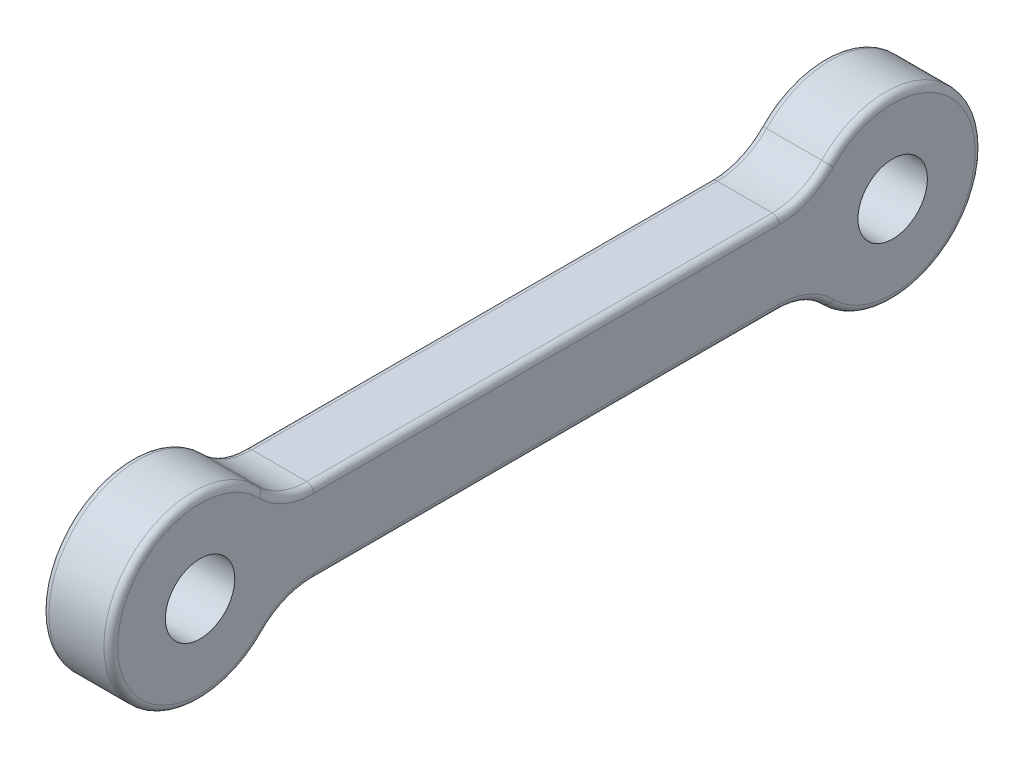
ISO-10303-21;
HEADER;
FILE_DESCRIPTION(('STEP AP214'),'2;1');
FILE_NAME('part.step','',(''),(''),'','','');
FILE_SCHEMA(('AUTOMOTIVE_DESIGN { 1 0 10303 214 1 1 1 1 }'));
ENDSEC;
DATA;
#1=APPLICATION_CONTEXT('core data for automotive mechanical design processes');
#2=APPLICATION_PROTOCOL_DEFINITION('international standard','automotive_design',2000,#1);
#3=PRODUCT_CONTEXT('',#1,'mechanical');
#4=PRODUCT('Part','Part','',(#3));
#5=PRODUCT_RELATED_PRODUCT_CATEGORY('part','',(#4));
#6=PRODUCT_DEFINITION_FORMATION('','',#4);
#7=PRODUCT_DEFINITION_CONTEXT('part definition',#1,'design');
#8=PRODUCT_DEFINITION('design','',#6,#7);
#9=PRODUCT_DEFINITION_SHAPE('','',#8);
#10=(LENGTH_UNIT() NAMED_UNIT(*) SI_UNIT(.MILLI.,.METRE.));
#11=(NAMED_UNIT(*) PLANE_ANGLE_UNIT() SI_UNIT($,.RADIAN.));
#12=(NAMED_UNIT(*) SI_UNIT($,.STERADIAN.) SOLID_ANGLE_UNIT());
#13=UNCERTAINTY_MEASURE_WITH_UNIT(LENGTH_MEASURE(1.E-05),#10,'distance_accuracy_value','');
#14=(GEOMETRIC_REPRESENTATION_CONTEXT(3) GLOBAL_UNCERTAINTY_ASSIGNED_CONTEXT((#13)) GLOBAL_UNIT_ASSIGNED_CONTEXT((#10,
#11,#12)) REPRESENTATION_CONTEXT('',''));
#15=CARTESIAN_POINT('',(0.,0.,0.));
#16=DIRECTION('',(0.,0.,1.));
#17=DIRECTION('',(1.,0.,0.));
#18=AXIS2_PLACEMENT_3D('',#15,#16,#17);
#19=CARTESIAN_POINT('',(10.,-16.,16.5227116418584));
#20=DIRECTION('',(-1.,0.,0.));
#21=DIRECTION('',(0.,0.,1.));
#22=AXIS2_PLACEMENT_3D('',#19,#20,#21);
#23=PLANE('',#22);
#24=DIRECTION('',(0.,0.,1.));
#25=VECTOR('',#24,1.);
#26=CARTESIAN_POINT('',(10.,5.,16.5227116418584));
#27=LINE('',#26,#25);
#28=CARTESIAN_POINT('',(10.,4.99999999999999,16.5227116418584));
#29=VERTEX_POINT('',#28);
#30=CARTESIAN_POINT('',(10.,5.,84.2272883581416));
#31=VERTEX_POINT('',#30);
#32=EDGE_CURVE('E55',#29,#31,#27,.T.);
#33=ORIENTED_EDGE('',*,*,#32,.T.);
#34=CARTESIAN_POINT('',(10.,16.,84.2272883581416));
#35=DIRECTION('',(-1.,0.,0.));
#36=DIRECTION('',(0.,0.,1.));
#37=AXIS2_PLACEMENT_3D('',#34,#35,#36);
#38=CIRCLE('',#37,11.);
#39=CARTESIAN_POINT('',(10.,8.34782608695652,92.1294547955521));
#40=VERTEX_POINT('',#39);
#41=EDGE_CURVE('E238',#31,#40,#38,.T.);
#42=ORIENTED_EDGE('',*,*,#41,.T.);
#43=CARTESIAN_POINT('',(10.,0.,100.75));
#44=DIRECTION('',(-1.,0.,0.));
#45=DIRECTION('',(0.,0.,1.));
#46=AXIS2_PLACEMENT_3D('',#43,#44,#45);
#47=CIRCLE('',#46,12.);
#48=CARTESIAN_POINT('',(10.,-8.34782608695652,92.1294547955521));
#49=VERTEX_POINT('',#48);
#50=EDGE_CURVE('E252',#40,#49,#47,.F.);
#51=ORIENTED_EDGE('',*,*,#50,.T.);
#52=CARTESIAN_POINT('',(10.,-16.,84.2272883581416));
#53=DIRECTION('',(-1.,0.,0.));
#54=DIRECTION('',(0.,0.,1.));
#55=AXIS2_PLACEMENT_3D('',#52,#53,#54);
#56=CIRCLE('',#55,11.);
#57=CARTESIAN_POINT('',(10.,-4.99999999999999,84.2272883581416));
#58=VERTEX_POINT('',#57);
#59=EDGE_CURVE('E250',#49,#58,#56,.T.);
#60=ORIENTED_EDGE('',*,*,#59,.T.);
#61=DIRECTION('',(0.,0.,-1.));
#62=VECTOR('',#61,1.);
#63=CARTESIAN_POINT('',(10.,-5.,16.5227116418584));
#64=LINE('',#63,#62);
#65=CARTESIAN_POINT('',(10.,-5.,16.5227116418584));
#66=VERTEX_POINT('',#65);
#67=EDGE_CURVE('E248',#58,#66,#64,.T.);
#68=ORIENTED_EDGE('',*,*,#67,.T.);
#69=CARTESIAN_POINT('',(10.,-16.,16.5227116418584));
#70=DIRECTION('',(-1.,0.,0.));
#71=DIRECTION('',(0.,0.,1.));
#72=AXIS2_PLACEMENT_3D('',#69,#70,#71);
#73=CIRCLE('',#72,11.);
#74=CARTESIAN_POINT('',(10.,-8.34782608695653,8.62054520444785));
#75=VERTEX_POINT('',#74);
#76=EDGE_CURVE('E246',#66,#75,#73,.T.);
#77=ORIENTED_EDGE('',*,*,#76,.T.);
#78=CARTESIAN_POINT('',(10.,0.,0.));
#79=DIRECTION('',(-1.,0.,0.));
#80=DIRECTION('',(0.,0.,1.));
#81=AXIS2_PLACEMENT_3D('',#78,#79,#80);
#82=CIRCLE('',#81,12.);
#83=CARTESIAN_POINT('',(10.,8.34782608695652,8.62054520444784));
#84=VERTEX_POINT('',#83);
#85=EDGE_CURVE('E244',#75,#84,#82,.F.);
#86=ORIENTED_EDGE('',*,*,#85,.T.);
#87=CARTESIAN_POINT('',(10.,16.,16.5227116418584));
#88=DIRECTION('',(-1.,0.,0.));
#89=DIRECTION('',(0.,0.,1.));
#90=AXIS2_PLACEMENT_3D('',#87,#88,#89);
#91=CIRCLE('',#90,11.);
#92=EDGE_CURVE('E60',#84,#29,#91,.T.);
#93=ORIENTED_EDGE('',*,*,#92,.T.);
#94=EDGE_LOOP('',(#33,#42,#51,#60,#68,#77,#86,#93));
#95=FACE_BOUND('',#94,.T.);
#96=CARTESIAN_POINT('',(10.,0.,100.75));
#97=DIRECTION('',(1.,0.,0.));
#98=DIRECTION('',(0.,0.,-1.));
#99=AXIS2_PLACEMENT_3D('',#96,#97,#98);
#100=CIRCLE('',#99,5.05);
#101=CARTESIAN_POINT('',(10.,0.,95.7));
#102=VERTEX_POINT('',#101);
#103=EDGE_CURVE('E311',#102,#102,#100,.T.);
#104=ORIENTED_EDGE('',*,*,#103,.F.);
#105=EDGE_LOOP('',(#104));
#106=FACE_BOUND('',#105,.T.);
#107=CARTESIAN_POINT('',(10.,0.,0.));
#108=DIRECTION('',(1.,0.,0.));
#109=DIRECTION('',(0.,0.,-1.));
#110=AXIS2_PLACEMENT_3D('',#107,#108,#109);
#111=CIRCLE('',#110,5.05);
#112=CARTESIAN_POINT('',(10.,0.,-5.05));
#113=VERTEX_POINT('',#112);
#114=EDGE_CURVE('E315',#113,#113,#111,.T.);
#115=ORIENTED_EDGE('',*,*,#114,.F.);
#116=EDGE_LOOP('',(#115));
#117=FACE_BOUND('',#116,.T.);
#118=ADVANCED_FACE('F38',(#95,#106,#117),#23,.F.);
#119=CARTESIAN_POINT('',(0.,-16.,16.5227116418584));
#120=DIRECTION('',(-1.,0.,0.));
#121=DIRECTION('',(0.,0.,1.));
#122=AXIS2_PLACEMENT_3D('',#119,#120,#121);
#123=PLANE('',#122);
#124=DIRECTION('',(0.,0.,1.));
#125=VECTOR('',#124,1.);
#126=CARTESIAN_POINT('',(0.,5.,16.5227116418584));
#127=LINE('',#126,#125);
#128=CARTESIAN_POINT('',(0.,5.,84.2272883581416));
#129=VERTEX_POINT('',#128);
#130=CARTESIAN_POINT('',(0.,5.,16.5227116418584));
#131=VERTEX_POINT('',#130);
#132=EDGE_CURVE('E292',#129,#131,#127,.F.);
#133=ORIENTED_EDGE('',*,*,#132,.T.);
#134=CARTESIAN_POINT('',(0.,16.,16.5227116418584));
#135=DIRECTION('',(-1.,0.,0.));
#136=DIRECTION('',(0.,0.,1.));
#137=AXIS2_PLACEMENT_3D('',#134,#135,#136);
#138=CIRCLE('',#137,11.);
#139=CARTESIAN_POINT('',(0.,8.34782608695652,8.62054520444784));
#140=VERTEX_POINT('',#139);
#141=EDGE_CURVE('E277',#131,#140,#138,.F.);
#142=ORIENTED_EDGE('',*,*,#141,.T.);
#143=CARTESIAN_POINT('',(0.,0.,0.));
#144=DIRECTION('',(-1.,0.,0.));
#145=DIRECTION('',(0.,0.,1.));
#146=AXIS2_PLACEMENT_3D('',#143,#144,#145);
#147=CIRCLE('',#146,12.);
#148=CARTESIAN_POINT('',(0.,-8.34782608695653,8.62054520444785));
#149=VERTEX_POINT('',#148);
#150=EDGE_CURVE('E280',#140,#149,#147,.T.);
#151=ORIENTED_EDGE('',*,*,#150,.T.);
#152=CARTESIAN_POINT('',(0.,-16.,16.5227116418584));
#153=DIRECTION('',(-1.,0.,0.));
#154=DIRECTION('',(0.,0.,1.));
#155=AXIS2_PLACEMENT_3D('',#152,#153,#154);
#156=CIRCLE('',#155,11.);
#157=CARTESIAN_POINT('',(0.,-5.,16.5227116418584));
#158=VERTEX_POINT('',#157);
#159=EDGE_CURVE('E282',#149,#158,#156,.F.);
#160=ORIENTED_EDGE('',*,*,#159,.T.);
#161=DIRECTION('',(0.,0.,-1.));
#162=VECTOR('',#161,1.);
#163=CARTESIAN_POINT('',(0.,-5.,84.2272883581416));
#164=LINE('',#163,#162);
#165=CARTESIAN_POINT('',(0.,-4.99999999999999,84.2272883581416));
#166=VERTEX_POINT('',#165);
#167=EDGE_CURVE('E284',#158,#166,#164,.F.);
#168=ORIENTED_EDGE('',*,*,#167,.T.);
#169=CARTESIAN_POINT('',(0.,-16.,84.2272883581416));
#170=DIRECTION('',(-1.,0.,0.));
#171=DIRECTION('',(0.,0.,1.));
#172=AXIS2_PLACEMENT_3D('',#169,#170,#171);
#173=CIRCLE('',#172,11.);
#174=CARTESIAN_POINT('',(0.,-8.34782608695652,92.1294547955522));
#175=VERTEX_POINT('',#174);
#176=EDGE_CURVE('E286',#166,#175,#173,.F.);
#177=ORIENTED_EDGE('',*,*,#176,.T.);
#178=CARTESIAN_POINT('',(0.,0.,100.75));
#179=DIRECTION('',(-1.,0.,0.));
#180=DIRECTION('',(0.,0.,1.));
#181=AXIS2_PLACEMENT_3D('',#178,#179,#180);
#182=CIRCLE('',#181,12.);
#183=CARTESIAN_POINT('',(0.,8.34782608695652,92.1294547955521));
#184=VERTEX_POINT('',#183);
#185=EDGE_CURVE('E288',#175,#184,#182,.T.);
#186=ORIENTED_EDGE('',*,*,#185,.T.);
#187=CARTESIAN_POINT('',(0.,16.,84.2272883581416));
#188=DIRECTION('',(-1.,0.,0.));
#189=DIRECTION('',(0.,0.,1.));
#190=AXIS2_PLACEMENT_3D('',#187,#188,#189);
#191=CIRCLE('',#190,11.);
#192=EDGE_CURVE('E290',#184,#129,#191,.F.);
#193=ORIENTED_EDGE('',*,*,#192,.T.);
#194=EDGE_LOOP('',(#133,#142,#151,#160,#168,#177,#186,#193));
#195=FACE_BOUND('',#194,.T.);
#196=CARTESIAN_POINT('',(0.,0.,100.75));
#197=DIRECTION('',(1.,0.,0.));
#198=DIRECTION('',(0.,0.,-1.));
#199=AXIS2_PLACEMENT_3D('',#196,#197,#198);
#200=CIRCLE('',#199,5.05);
#201=CARTESIAN_POINT('',(0.,0.,95.7));
#202=VERTEX_POINT('',#201);
#203=EDGE_CURVE('E312',#202,#202,#200,.T.);
#204=ORIENTED_EDGE('',*,*,#203,.T.);
#205=EDGE_LOOP('',(#204));
#206=FACE_BOUND('',#205,.T.);
#207=CARTESIAN_POINT('',(0.,0.,0.));
#208=DIRECTION('',(1.,0.,0.));
#209=DIRECTION('',(0.,0.,-1.));
#210=AXIS2_PLACEMENT_3D('',#207,#208,#209);
#211=CIRCLE('',#210,5.05);
#212=CARTESIAN_POINT('',(0.,0.,-5.05));
#213=VERTEX_POINT('',#212);
#214=EDGE_CURVE('E230',#213,#213,#211,.T.);
#215=ORIENTED_EDGE('',*,*,#214,.T.);
#216=EDGE_LOOP('',(#215));
#217=FACE_BOUND('',#216,.T.);
#218=ADVANCED_FACE('F327',(#195,#206,#217),#123,.T.);
#219=CARTESIAN_POINT('',(10.,-16.,16.5227116418584));
#220=DIRECTION('',(-1.,0.,0.));
#221=DIRECTION('',(0.,0.,1.));
#222=AXIS2_PLACEMENT_3D('',#219,#220,#221);
#223=CYLINDRICAL_SURFACE('',#222,10.);
#224=DIRECTION('',(-1.,0.,0.));
#225=VECTOR('',#224,1.);
#226=CARTESIAN_POINT('',(10.,-6.,16.5227116418584));
#227=LINE('',#226,#225);
#228=CARTESIAN_POINT('',(9.,-6.,16.5227116418584));
#229=VERTEX_POINT('',#228);
#230=CARTESIAN_POINT('',(0.999999999999999,-6.,16.5227116418584));
#231=VERTEX_POINT('',#230);
#232=EDGE_CURVE('E308',#229,#231,#227,.T.);
#233=ORIENTED_EDGE('',*,*,#232,.T.);
#234=CARTESIAN_POINT('',(0.999999999999999,-16.,16.5227116418584));
#235=DIRECTION('',(-1.,0.,0.));
#236=DIRECTION('',(0.,0.,1.));
#237=AXIS2_PLACEMENT_3D('',#234,#235,#236);
#238=CIRCLE('',#237,10.);
#239=CARTESIAN_POINT('',(0.999999999999999,-9.04347826086956,9.33892397148516));
#240=VERTEX_POINT('',#239);
#241=EDGE_CURVE('E269',#231,#240,#238,.T.);
#242=ORIENTED_EDGE('',*,*,#241,.T.);
#243=DIRECTION('',(-1.,0.,0.));
#244=VECTOR('',#243,1.);
#245=CARTESIAN_POINT('',(10.,-9.04347826086956,9.33892397148516));
#246=LINE('',#245,#244);
#247=CARTESIAN_POINT('',(9.,-9.04347826086956,9.33892397148516));
#248=VERTEX_POINT('',#247);
#249=EDGE_CURVE('E178',#248,#240,#246,.T.);
#250=ORIENTED_EDGE('',*,*,#249,.F.);
#251=CARTESIAN_POINT('',(9.,-16.,16.5227116418584));
#252=DIRECTION('',(-1.,0.,0.));
#253=DIRECTION('',(0.,0.,1.));
#254=AXIS2_PLACEMENT_3D('',#251,#252,#253);
#255=CIRCLE('',#254,10.);
#256=EDGE_CURVE('E271',#248,#229,#255,.F.);
#257=ORIENTED_EDGE('',*,*,#256,.T.);
#258=EDGE_LOOP('',(#233,#242,#250,#257));
#259=FACE_BOUND('',#258,.T.);
#260=ADVANCED_FACE('F332',(#259),#223,.F.);
#261=CARTESIAN_POINT('',(10.,0.,0.));
#262=DIRECTION('',(-1.,0.,0.));
#263=DIRECTION('',(0.,0.,1.));
#264=AXIS2_PLACEMENT_3D('',#261,#262,#263);
#265=CYLINDRICAL_SURFACE('',#264,13.);
#266=ORIENTED_EDGE('',*,*,#249,.T.);
#267=CARTESIAN_POINT('',(0.999999999999999,0.,0.));
#268=DIRECTION('',(-1.,0.,0.));
#269=DIRECTION('',(0.,0.,1.));
#270=AXIS2_PLACEMENT_3D('',#267,#268,#269);
#271=CIRCLE('',#270,13.);
#272=CARTESIAN_POINT('',(0.999999999999999,9.04347826086957,9.33892397148517));
#273=VERTEX_POINT('',#272);
#274=EDGE_CURVE('E273',#240,#273,#271,.F.);
#275=ORIENTED_EDGE('',*,*,#274,.T.);
#276=DIRECTION('',(-1.,0.,0.));
#277=VECTOR('',#276,1.);
#278=CARTESIAN_POINT('',(10.,9.04347826086957,9.33892397148517));
#279=LINE('',#278,#277);
#280=CARTESIAN_POINT('',(9.,9.04347826086957,9.33892397148517));
#281=VERTEX_POINT('',#280);
#282=EDGE_CURVE('E170',#281,#273,#279,.T.);
#283=ORIENTED_EDGE('',*,*,#282,.F.);
#284=CARTESIAN_POINT('',(9.,0.,0.));
#285=DIRECTION('',(-1.,0.,0.));
#286=DIRECTION('',(0.,0.,1.));
#287=AXIS2_PLACEMENT_3D('',#284,#285,#286);
#288=CIRCLE('',#287,13.);
#289=EDGE_CURVE('E275',#281,#248,#288,.T.);
#290=ORIENTED_EDGE('',*,*,#289,.T.);
#291=EDGE_LOOP('',(#266,#275,#283,#290));
#292=FACE_BOUND('',#291,.T.);
#293=ADVANCED_FACE('F360',(#292),#265,.T.);
#294=CARTESIAN_POINT('',(10.,16.,16.5227116418584));
#295=DIRECTION('',(-1.,0.,0.));
#296=DIRECTION('',(0.,0.,1.));
#297=AXIS2_PLACEMENT_3D('',#294,#295,#296);
#298=CYLINDRICAL_SURFACE('',#297,10.);
#299=ORIENTED_EDGE('',*,*,#282,.T.);
#300=CARTESIAN_POINT('',(0.999999999999999,16.,16.5227116418584));
#301=DIRECTION('',(-1.,0.,0.));
#302=DIRECTION('',(0.,0.,1.));
#303=AXIS2_PLACEMENT_3D('',#300,#301,#302);
#304=CIRCLE('',#303,10.);
#305=CARTESIAN_POINT('',(0.999999999999999,6.,16.5227116418584));
#306=VERTEX_POINT('',#305);
#307=EDGE_CURVE('E169',#273,#306,#304,.T.);
#308=ORIENTED_EDGE('',*,*,#307,.T.);
#309=DIRECTION('',(-1.,0.,0.));
#310=VECTOR('',#309,1.);
#311=CARTESIAN_POINT('',(10.,6.,16.5227116418584));
#312=LINE('',#311,#310);
#313=CARTESIAN_POINT('',(9.,6.,16.5227116418584));
#314=VERTEX_POINT('',#313);
#315=EDGE_CURVE('E155',#314,#306,#312,.T.);
#316=ORIENTED_EDGE('',*,*,#315,.F.);
#317=CARTESIAN_POINT('',(9.,16.,16.5227116418584));
#318=DIRECTION('',(-1.,0.,0.));
#319=DIRECTION('',(0.,0.,1.));
#320=AXIS2_PLACEMENT_3D('',#317,#318,#319);
#321=CIRCLE('',#320,10.);
#322=EDGE_CURVE('E166',#314,#281,#321,.F.);
#323=ORIENTED_EDGE('',*,*,#322,.T.);
#324=EDGE_LOOP('',(#299,#308,#316,#323));
#325=FACE_BOUND('',#324,.T.);
#326=ADVANCED_FACE('F165',(#325),#298,.F.);
#327=CARTESIAN_POINT('',(10.,6.,84.2272883581416));
#328=DIRECTION('',(0.,-1.,0.));
#329=DIRECTION('',(0.,0.,-1.));
#330=AXIS2_PLACEMENT_3D('',#327,#328,#329);
#331=PLANE('',#330);
#332=DIRECTION('',(-1.,0.,0.));
#333=VECTOR('',#332,1.);
#334=CARTESIAN_POINT('',(10.,5.99999999999999,84.2272883581416));
#335=LINE('',#334,#333);
#336=CARTESIAN_POINT('',(9.,5.99999999999999,84.2272883581416));
#337=VERTEX_POINT('',#336);
#338=CARTESIAN_POINT('',(0.999999999999999,5.99999999999999,84.2272883581416));
#339=VERTEX_POINT('',#338);
#340=EDGE_CURVE('E157',#337,#339,#335,.T.);
#341=ORIENTED_EDGE('',*,*,#340,.F.);
#342=DIRECTION('',(0.,0.,1.));
#343=VECTOR('',#342,1.);
#344=CARTESIAN_POINT('',(9.,6.,84.2272883581416));
#345=LINE('',#344,#343);
#346=EDGE_CURVE('E11',#337,#314,#345,.F.);
#347=ORIENTED_EDGE('',*,*,#346,.T.);
#348=ORIENTED_EDGE('',*,*,#315,.T.);
#349=DIRECTION('',(0.,0.,1.));
#350=VECTOR('',#349,1.);
#351=CARTESIAN_POINT('',(0.999999999999999,6.,84.2272883581416));
#352=LINE('',#351,#350);
#353=EDGE_CURVE('E47',#306,#339,#352,.T.);
#354=ORIENTED_EDGE('',*,*,#353,.T.);
#355=EDGE_LOOP('',(#341,#347,#348,#354));
#356=FACE_BOUND('',#355,.T.);
#357=ADVANCED_FACE('F154',(#356),#331,.F.);
#358=CARTESIAN_POINT('',(10.,16.,84.2272883581416));
#359=DIRECTION('',(-1.,0.,0.));
#360=DIRECTION('',(0.,0.,1.));
#361=AXIS2_PLACEMENT_3D('',#358,#359,#360);
#362=CYLINDRICAL_SURFACE('',#361,10.);
#363=ORIENTED_EDGE('',*,*,#340,.T.);
#364=CARTESIAN_POINT('',(0.999999999999999,16.,84.2272883581416));
#365=DIRECTION('',(-1.,0.,0.));
#366=DIRECTION('',(0.,0.,1.));
#367=AXIS2_PLACEMENT_3D('',#364,#365,#366);
#368=CIRCLE('',#367,10.);
#369=CARTESIAN_POINT('',(0.999999999999999,9.04347826086956,91.4110760285148));
#370=VERTEX_POINT('',#369);
#371=EDGE_CURVE('E254',#339,#370,#368,.T.);
#372=ORIENTED_EDGE('',*,*,#371,.T.);
#373=DIRECTION('',(-1.,0.,0.));
#374=VECTOR('',#373,1.);
#375=CARTESIAN_POINT('',(10.,9.04347826086956,91.4110760285148));
#376=LINE('',#375,#374);
#377=CARTESIAN_POINT('',(9.,9.04347826086956,91.4110760285148));
#378=VERTEX_POINT('',#377);
#379=EDGE_CURVE('E299',#378,#370,#376,.T.);
#380=ORIENTED_EDGE('',*,*,#379,.F.);
#381=CARTESIAN_POINT('',(9.,16.,84.2272883581416));
#382=DIRECTION('',(-1.,0.,0.));
#383=DIRECTION('',(0.,0.,1.));
#384=AXIS2_PLACEMENT_3D('',#381,#382,#383);
#385=CIRCLE('',#384,10.);
#386=EDGE_CURVE('E236',#378,#337,#385,.F.);
#387=ORIENTED_EDGE('',*,*,#386,.T.);
#388=EDGE_LOOP('',(#363,#372,#380,#387));
#389=FACE_BOUND('',#388,.T.);
#390=ADVANCED_FACE('F351',(#389),#362,.F.);
#391=CARTESIAN_POINT('',(10.,0.,100.75));
#392=DIRECTION('',(-1.,0.,0.));
#393=DIRECTION('',(0.,0.,1.));
#394=AXIS2_PLACEMENT_3D('',#391,#392,#393);
#395=CYLINDRICAL_SURFACE('',#394,13.);
#396=ORIENTED_EDGE('',*,*,#379,.T.);
#397=CARTESIAN_POINT('',(0.999999999999999,0.,100.75));
#398=DIRECTION('',(-1.,0.,0.));
#399=DIRECTION('',(0.,0.,1.));
#400=AXIS2_PLACEMENT_3D('',#397,#398,#399);
#401=CIRCLE('',#400,13.);
#402=CARTESIAN_POINT('',(0.999999999999999,-9.04347826086957,91.4110760285148));
#403=VERTEX_POINT('',#402);
#404=EDGE_CURVE('E257',#370,#403,#401,.F.);
#405=ORIENTED_EDGE('',*,*,#404,.T.);
#406=DIRECTION('',(-1.,0.,0.));
#407=VECTOR('',#406,1.);
#408=CARTESIAN_POINT('',(10.,-9.04347826086957,91.4110760285148));
#409=LINE('',#408,#407);
#410=CARTESIAN_POINT('',(9.,-9.04347826086957,91.4110760285148));
#411=VERTEX_POINT('',#410);
#412=EDGE_CURVE('E302',#411,#403,#409,.T.);
#413=ORIENTED_EDGE('',*,*,#412,.F.);
#414=CARTESIAN_POINT('',(9.,0.,100.75));
#415=DIRECTION('',(-1.,0.,0.));
#416=DIRECTION('',(0.,0.,1.));
#417=AXIS2_PLACEMENT_3D('',#414,#415,#416);
#418=CIRCLE('',#417,13.);
#419=EDGE_CURVE('E259',#411,#378,#418,.T.);
#420=ORIENTED_EDGE('',*,*,#419,.T.);
#421=EDGE_LOOP('',(#396,#405,#413,#420));
#422=FACE_BOUND('',#421,.T.);
#423=ADVANCED_FACE('F347',(#422),#395,.T.);
#424=CARTESIAN_POINT('',(10.,-16.,84.2272883581416));
#425=DIRECTION('',(-1.,0.,0.));
#426=DIRECTION('',(0.,0.,1.));
#427=AXIS2_PLACEMENT_3D('',#424,#425,#426);
#428=CYLINDRICAL_SURFACE('',#427,10.);
#429=ORIENTED_EDGE('',*,*,#412,.T.);
#430=CARTESIAN_POINT('',(0.999999999999999,-16.,84.2272883581416));
#431=DIRECTION('',(-1.,0.,0.));
#432=DIRECTION('',(0.,0.,1.));
#433=AXIS2_PLACEMENT_3D('',#430,#431,#432);
#434=CIRCLE('',#433,10.);
#435=CARTESIAN_POINT('',(0.999999999999999,-6.,84.2272883581416));
#436=VERTEX_POINT('',#435);
#437=EDGE_CURVE('E261',#403,#436,#434,.T.);
#438=ORIENTED_EDGE('',*,*,#437,.T.);
#439=DIRECTION('',(-1.,0.,0.));
#440=VECTOR('',#439,1.);
#441=CARTESIAN_POINT('',(10.,-6.,84.2272883581416));
#442=LINE('',#441,#440);
#443=CARTESIAN_POINT('',(9.,-6.,84.2272883581416));
#444=VERTEX_POINT('',#443);
#445=EDGE_CURVE('E305',#444,#436,#442,.T.);
#446=ORIENTED_EDGE('',*,*,#445,.F.);
#447=CARTESIAN_POINT('',(9.,-16.,84.2272883581416));
#448=DIRECTION('',(-1.,0.,0.));
#449=DIRECTION('',(0.,0.,1.));
#450=AXIS2_PLACEMENT_3D('',#447,#448,#449);
#451=CIRCLE('',#450,10.);
#452=EDGE_CURVE('E263',#444,#411,#451,.F.);
#453=ORIENTED_EDGE('',*,*,#452,.T.);
#454=EDGE_LOOP('',(#429,#438,#446,#453));
#455=FACE_BOUND('',#454,.T.);
#456=ADVANCED_FACE('F343',(#455),#428,.F.);
#457=CARTESIAN_POINT('',(10.,-6.,84.2272883581416));
#458=DIRECTION('',(0.,1.,0.));
#459=DIRECTION('',(0.,0.,1.));
#460=AXIS2_PLACEMENT_3D('',#457,#458,#459);
#461=PLANE('',#460);
#462=ORIENTED_EDGE('',*,*,#445,.T.);
#463=DIRECTION('',(0.,0.,-1.));
#464=VECTOR('',#463,1.);
#465=CARTESIAN_POINT('',(0.999999999999999,-6.,16.5227116418584));
#466=LINE('',#465,#464);
#467=EDGE_CURVE('E265',#436,#231,#466,.T.);
#468=ORIENTED_EDGE('',*,*,#467,.T.);
#469=ORIENTED_EDGE('',*,*,#232,.F.);
#470=DIRECTION('',(0.,0.,-1.));
#471=VECTOR('',#470,1.);
#472=CARTESIAN_POINT('',(9.,-6.,84.2272883581416));
#473=LINE('',#472,#471);
#474=EDGE_CURVE('E267',#229,#444,#473,.F.);
#475=ORIENTED_EDGE('',*,*,#474,.T.);
#476=EDGE_LOOP('',(#462,#468,#469,#475));
#477=FACE_BOUND('',#476,.T.);
#478=ADVANCED_FACE('F340',(#477),#461,.F.);
#479=CARTESIAN_POINT('',(10.,0.,100.75));
#480=DIRECTION('',(-1.,0.,0.));
#481=DIRECTION('',(0.,0.,1.));
#482=AXIS2_PLACEMENT_3D('',#479,#480,#481);
#483=CYLINDRICAL_SURFACE('',#482,5.05);
#484=ORIENTED_EDGE('',*,*,#103,.T.);
#485=EDGE_LOOP('',(#484));
#486=FACE_BOUND('',#485,.T.);
#487=ORIENTED_EDGE('',*,*,#203,.F.);
#488=EDGE_LOOP('',(#487));
#489=FACE_BOUND('',#488,.T.);
#490=ADVANCED_FACE('F337',(#486,#489),#483,.F.);
#491=CARTESIAN_POINT('',(10.,0.,0.));
#492=DIRECTION('',(-1.,0.,0.));
#493=DIRECTION('',(0.,0.,1.));
#494=AXIS2_PLACEMENT_3D('',#491,#492,#493);
#495=CYLINDRICAL_SURFACE('',#494,5.05);
#496=ORIENTED_EDGE('',*,*,#114,.T.);
#497=EDGE_LOOP('',(#496));
#498=FACE_BOUND('',#497,.T.);
#499=ORIENTED_EDGE('',*,*,#214,.F.);
#500=EDGE_LOOP('',(#499));
#501=FACE_BOUND('',#500,.T.);
#502=ADVANCED_FACE('F323',(#498,#501),#495,.F.);
#503=CARTESIAN_POINT('',(0.999999999999999,-16.,84.2272883581416));
#504=DIRECTION('',(-1.,0.,0.));
#505=DIRECTION('',(0.,0.,1.));
#506=AXIS2_PLACEMENT_3D('',#503,#504,#505);
#507=TOROIDAL_SURFACE('',#506,11.,1.);
#508=CARTESIAN_POINT('',(1.,-8.34782608695653,92.1294547955521));
#509=DIRECTION('',(0.,-0.718378767037317,0.695652173913044));
#510=DIRECTION('',(0.,-0.695652173913044,-0.718378767037317));
#511=AXIS2_PLACEMENT_3D('',#508,#509,#510);
#512=CIRCLE('',#511,1.);
#513=EDGE_CURVE('E224',#175,#403,#512,.T.);
#514=ORIENTED_EDGE('',*,*,#513,.F.);
#515=ORIENTED_EDGE('',*,*,#176,.F.);
#516=CARTESIAN_POINT('',(0.999999999999999,-4.99999999999999,84.2272883581416));
#517=DIRECTION('',(0.,0.,-1.));
#518=DIRECTION('',(-1.,0.,0.));
#519=AXIS2_PLACEMENT_3D('',#516,#517,#518);
#520=CIRCLE('',#519,1.);
#521=EDGE_CURVE('E227',#436,#166,#520,.T.);
#522=ORIENTED_EDGE('',*,*,#521,.F.);
#523=ORIENTED_EDGE('',*,*,#437,.F.);
#524=EDGE_LOOP('',(#514,#515,#522,#523));
#525=FACE_BOUND('',#524,.T.);
#526=ADVANCED_FACE('F393',(#525),#507,.T.);
#527=CARTESIAN_POINT('',(0.999999999999999,-5.,84.2272883581416));
#528=DIRECTION('',(0.,0.,1.));
#529=DIRECTION('',(1.,0.,0.));
#530=AXIS2_PLACEMENT_3D('',#527,#528,#529);
#531=CYLINDRICAL_SURFACE('',#530,1.);
#532=ORIENTED_EDGE('',*,*,#521,.T.);
#533=ORIENTED_EDGE('',*,*,#167,.F.);
#534=CARTESIAN_POINT('',(0.999999999999999,-5.,16.5227116418584));
#535=DIRECTION('',(0.,0.,-1.));
#536=DIRECTION('',(-1.,0.,0.));
#537=AXIS2_PLACEMENT_3D('',#534,#535,#536);
#538=CIRCLE('',#537,1.);
#539=EDGE_CURVE('E221',#231,#158,#538,.T.);
#540=ORIENTED_EDGE('',*,*,#539,.F.);
#541=ORIENTED_EDGE('',*,*,#467,.F.);
#542=EDGE_LOOP('',(#532,#533,#540,#541));
#543=FACE_BOUND('',#542,.T.);
#544=ADVANCED_FACE('F389',(#543),#531,.T.);
#545=CARTESIAN_POINT('',(0.999999999999999,0.,100.75));
#546=DIRECTION('',(-1.,0.,0.));
#547=DIRECTION('',(0.,0.,1.));
#548=AXIS2_PLACEMENT_3D('',#545,#546,#547);
#549=TOROIDAL_SURFACE('',#548,12.,1.);
#550=ORIENTED_EDGE('',*,*,#513,.T.);
#551=ORIENTED_EDGE('',*,*,#404,.F.);
#552=CARTESIAN_POINT('',(1.,8.34782608695652,92.1294547955521));
#553=DIRECTION('',(0.,-0.718378767037315,-0.695652173913046));
#554=DIRECTION('',(0.,0.695652173913046,-0.718378767037315));
#555=AXIS2_PLACEMENT_3D('',#552,#553,#554);
#556=CIRCLE('',#555,1.);
#557=EDGE_CURVE('E218',#184,#370,#556,.T.);
#558=ORIENTED_EDGE('',*,*,#557,.F.);
#559=ORIENTED_EDGE('',*,*,#185,.F.);
#560=EDGE_LOOP('',(#550,#551,#558,#559));
#561=FACE_BOUND('',#560,.T.);
#562=ADVANCED_FACE('F385',(#561),#549,.T.);
#563=CARTESIAN_POINT('',(0.999999999999999,-16.,16.5227116418584));
#564=DIRECTION('',(-1.,0.,0.));
#565=DIRECTION('',(0.,0.,1.));
#566=AXIS2_PLACEMENT_3D('',#563,#564,#565);
#567=TOROIDAL_SURFACE('',#566,11.,1.);
#568=ORIENTED_EDGE('',*,*,#539,.T.);
#569=ORIENTED_EDGE('',*,*,#159,.F.);
#570=CARTESIAN_POINT('',(0.999999999999999,-8.34782608695652,8.62054520444785));
#571=DIRECTION('',(0.,-0.718378767037319,-0.695652173913042));
#572=DIRECTION('',(0.,0.695652173913042,-0.71837876703732));
#573=AXIS2_PLACEMENT_3D('',#570,#571,#572);
#574=CIRCLE('',#573,1.);
#575=EDGE_CURVE('E215',#240,#149,#574,.T.);
#576=ORIENTED_EDGE('',*,*,#575,.F.);
#577=ORIENTED_EDGE('',*,*,#241,.F.);
#578=EDGE_LOOP('',(#568,#569,#576,#577));
#579=FACE_BOUND('',#578,.T.);
#580=ADVANCED_FACE('F381',(#579),#567,.T.);
#581=CARTESIAN_POINT('',(0.999999999999999,16.,84.2272883581416));
#582=DIRECTION('',(-1.,0.,0.));
#583=DIRECTION('',(0.,0.,1.));
#584=AXIS2_PLACEMENT_3D('',#581,#582,#583);
#585=TOROIDAL_SURFACE('',#584,11.,1.);
#586=ORIENTED_EDGE('',*,*,#557,.T.);
#587=ORIENTED_EDGE('',*,*,#371,.F.);
#588=CARTESIAN_POINT('',(1.,4.99999999999999,84.2272883581416));
#589=DIRECTION('',(0.,0.,-1.));
#590=DIRECTION('',(-1.,0.,0.));
#591=AXIS2_PLACEMENT_3D('',#588,#589,#590);
#592=CIRCLE('',#591,1.);
#593=EDGE_CURVE('E209',#129,#339,#592,.T.);
#594=ORIENTED_EDGE('',*,*,#593,.F.);
#595=ORIENTED_EDGE('',*,*,#192,.F.);
#596=EDGE_LOOP('',(#586,#587,#594,#595));
#597=FACE_BOUND('',#596,.T.);
#598=ADVANCED_FACE('F377',(#597),#585,.T.);
#599=CARTESIAN_POINT('',(0.999999999999999,0.,0.));
#600=DIRECTION('',(-1.,0.,0.));
#601=DIRECTION('',(0.,0.,1.));
#602=AXIS2_PLACEMENT_3D('',#599,#600,#601);
#603=TOROIDAL_SURFACE('',#602,12.,1.);
#604=ORIENTED_EDGE('',*,*,#575,.T.);
#605=ORIENTED_EDGE('',*,*,#150,.F.);
#606=CARTESIAN_POINT('',(0.999999999999999,8.34782608695652,8.62054520444784));
#607=DIRECTION('',(0.,-0.718378767037319,0.695652173913042));
#608=DIRECTION('',(0.,-0.695652173913042,-0.71837876703732));
#609=AXIS2_PLACEMENT_3D('',#606,#607,#608);
#610=CIRCLE('',#609,1.);
#611=EDGE_CURVE('E203',#273,#140,#610,.T.);
#612=ORIENTED_EDGE('',*,*,#611,.F.);
#613=ORIENTED_EDGE('',*,*,#274,.F.);
#614=EDGE_LOOP('',(#604,#605,#612,#613));
#615=FACE_BOUND('',#614,.T.);
#616=ADVANCED_FACE('F373',(#615),#603,.T.);
#617=CARTESIAN_POINT('',(0.999999999999999,5.,84.2272883581416));
#618=DIRECTION('',(0.,0.,-1.));
#619=DIRECTION('',(-1.,0.,0.));
#620=AXIS2_PLACEMENT_3D('',#617,#618,#619);
#621=CYLINDRICAL_SURFACE('',#620,1.);
#622=ORIENTED_EDGE('',*,*,#593,.T.);
#623=ORIENTED_EDGE('',*,*,#353,.F.);
#624=CARTESIAN_POINT('',(1.,5.,16.5227116418584));
#625=DIRECTION('',(0.,0.,-1.));
#626=DIRECTION('',(-1.,0.,0.));
#627=AXIS2_PLACEMENT_3D('',#624,#625,#626);
#628=CIRCLE('',#627,1.);
#629=EDGE_CURVE('E198',#131,#306,#628,.T.);
#630=ORIENTED_EDGE('',*,*,#629,.F.);
#631=ORIENTED_EDGE('',*,*,#132,.F.);
#632=EDGE_LOOP('',(#622,#623,#630,#631));
#633=FACE_BOUND('',#632,.T.);
#634=ADVANCED_FACE('F370',(#633),#621,.T.);
#635=CARTESIAN_POINT('',(0.999999999999999,16.,16.5227116418584));
#636=DIRECTION('',(-1.,0.,0.));
#637=DIRECTION('',(0.,0.,1.));
#638=AXIS2_PLACEMENT_3D('',#635,#636,#637);
#639=TOROIDAL_SURFACE('',#638,11.,1.);
#640=ORIENTED_EDGE('',*,*,#611,.T.);
#641=ORIENTED_EDGE('',*,*,#141,.F.);
#642=ORIENTED_EDGE('',*,*,#629,.T.);
#643=ORIENTED_EDGE('',*,*,#307,.F.);
#644=EDGE_LOOP('',(#640,#641,#642,#643));
#645=FACE_BOUND('',#644,.T.);
#646=ADVANCED_FACE('F367',(#645),#639,.T.);
#647=CARTESIAN_POINT('',(9.,-16.,16.5227116418584));
#648=DIRECTION('',(-1.,0.,0.));
#649=DIRECTION('',(0.,0.,1.));
#650=AXIS2_PLACEMENT_3D('',#647,#648,#649);
#651=TOROIDAL_SURFACE('',#650,11.,1.);
#652=CARTESIAN_POINT('',(9.,-4.99999999999999,16.5227116418584));
#653=DIRECTION('',(0.,0.,1.));
#654=DIRECTION('',(1.,0.,0.));
#655=AXIS2_PLACEMENT_3D('',#652,#653,#654);
#656=CIRCLE('',#655,1.);
#657=EDGE_CURVE('E191',#229,#66,#656,.T.);
#658=ORIENTED_EDGE('',*,*,#657,.F.);
#659=ORIENTED_EDGE('',*,*,#256,.F.);
#660=CARTESIAN_POINT('',(9.,-8.34782608695653,8.62054520444785));
#661=DIRECTION('',(0.,-0.71837876703732,-0.695652173913041));
#662=DIRECTION('',(0.,0.695652173913041,-0.71837876703732));
#663=AXIS2_PLACEMENT_3D('',#660,#661,#662);
#664=CIRCLE('',#663,1.);
#665=EDGE_CURVE('E42',#75,#248,#664,.T.);
#666=ORIENTED_EDGE('',*,*,#665,.F.);
#667=ORIENTED_EDGE('',*,*,#76,.F.);
#668=EDGE_LOOP('',(#658,#659,#666,#667));
#669=FACE_BOUND('',#668,.T.);
#670=ADVANCED_FACE('F40',(#669),#651,.T.);
#671=CARTESIAN_POINT('',(9.,0.,0.));
#672=DIRECTION('',(-1.,0.,0.));
#673=DIRECTION('',(0.,0.,1.));
#674=AXIS2_PLACEMENT_3D('',#671,#672,#673);
#675=TOROIDAL_SURFACE('',#674,12.,1.);
#676=ORIENTED_EDGE('',*,*,#665,.T.);
#677=ORIENTED_EDGE('',*,*,#289,.F.);
#678=CARTESIAN_POINT('',(9.,8.34782608695652,8.62054520444784));
#679=DIRECTION('',(0.,-0.718378767037319,0.695652173913042));
#680=DIRECTION('',(0.,-0.695652173913043,-0.718378767037319));
#681=AXIS2_PLACEMENT_3D('',#678,#679,#680);
#682=CIRCLE('',#681,1.);
#683=EDGE_CURVE('E177',#84,#281,#682,.T.);
#684=ORIENTED_EDGE('',*,*,#683,.F.);
#685=ORIENTED_EDGE('',*,*,#85,.F.);
#686=EDGE_LOOP('',(#676,#677,#684,#685));
#687=FACE_BOUND('',#686,.T.);
#688=ADVANCED_FACE('F414',(#687),#675,.T.);
#689=CARTESIAN_POINT('',(9.,-5.,16.5227116418584));
#690=DIRECTION('',(0.,0.,-1.));
#691=DIRECTION('',(-1.,0.,0.));
#692=AXIS2_PLACEMENT_3D('',#689,#690,#691);
#693=CYLINDRICAL_SURFACE('',#692,1.);
#694=ORIENTED_EDGE('',*,*,#657,.T.);
#695=ORIENTED_EDGE('',*,*,#67,.F.);
#696=CARTESIAN_POINT('',(9.,-5.,84.2272883581416));
#697=DIRECTION('',(0.,0.,1.));
#698=DIRECTION('',(1.,0.,0.));
#699=AXIS2_PLACEMENT_3D('',#696,#697,#698);
#700=CIRCLE('',#699,1.);
#701=EDGE_CURVE('E181',#444,#58,#700,.T.);
#702=ORIENTED_EDGE('',*,*,#701,.F.);
#703=ORIENTED_EDGE('',*,*,#474,.F.);
#704=EDGE_LOOP('',(#694,#695,#702,#703));
#705=FACE_BOUND('',#704,.T.);
#706=ADVANCED_FACE('F412',(#705),#693,.T.);
#707=CARTESIAN_POINT('',(9.,16.,16.5227116418584));
#708=DIRECTION('',(-1.,0.,0.));
#709=DIRECTION('',(0.,0.,1.));
#710=AXIS2_PLACEMENT_3D('',#707,#708,#709);
#711=TOROIDAL_SURFACE('',#710,11.,1.);
#712=ORIENTED_EDGE('',*,*,#683,.T.);
#713=ORIENTED_EDGE('',*,*,#322,.F.);
#714=CARTESIAN_POINT('',(9.,4.99999999999999,16.5227116418584));
#715=DIRECTION('',(0.,0.,1.));
#716=DIRECTION('',(1.,0.,0.));
#717=AXIS2_PLACEMENT_3D('',#714,#715,#716);
#718=CIRCLE('',#717,1.);
#719=EDGE_CURVE('E175',#29,#314,#718,.T.);
#720=ORIENTED_EDGE('',*,*,#719,.F.);
#721=ORIENTED_EDGE('',*,*,#92,.F.);
#722=EDGE_LOOP('',(#712,#713,#720,#721));
#723=FACE_BOUND('',#722,.T.);
#724=ADVANCED_FACE('F174',(#723),#711,.T.);
#725=CARTESIAN_POINT('',(9.,-16.,84.2272883581416));
#726=DIRECTION('',(-1.,0.,0.));
#727=DIRECTION('',(0.,0.,1.));
#728=AXIS2_PLACEMENT_3D('',#725,#726,#727);
#729=TOROIDAL_SURFACE('',#728,11.,1.);
#730=ORIENTED_EDGE('',*,*,#701,.T.);
#731=ORIENTED_EDGE('',*,*,#59,.F.);
#732=CARTESIAN_POINT('',(9.,-8.34782608695653,92.1294547955521));
#733=DIRECTION('',(0.,-0.718378767037317,0.695652173913044));
#734=DIRECTION('',(0.,-0.695652173913044,-0.718378767037317));
#735=AXIS2_PLACEMENT_3D('',#732,#733,#734);
#736=CIRCLE('',#735,1.);
#737=EDGE_CURVE('E182',#411,#49,#736,.T.);
#738=ORIENTED_EDGE('',*,*,#737,.F.);
#739=ORIENTED_EDGE('',*,*,#452,.F.);
#740=EDGE_LOOP('',(#730,#731,#738,#739));
#741=FACE_BOUND('',#740,.T.);
#742=ADVANCED_FACE('F406',(#741),#729,.T.);
#743=CARTESIAN_POINT('',(9.,5.,16.5227116418584));
#744=DIRECTION('',(0.,0.,1.));
#745=DIRECTION('',(1.,0.,0.));
#746=AXIS2_PLACEMENT_3D('',#743,#744,#745);
#747=CYLINDRICAL_SURFACE('',#746,1.);
#748=ORIENTED_EDGE('',*,*,#719,.T.);
#749=ORIENTED_EDGE('',*,*,#346,.F.);
#750=CARTESIAN_POINT('',(9.,5.,84.2272883581416));
#751=DIRECTION('',(0.,0.,1.));
#752=DIRECTION('',(1.,0.,0.));
#753=AXIS2_PLACEMENT_3D('',#750,#751,#752);
#754=CIRCLE('',#753,1.);
#755=EDGE_CURVE('E187',#31,#337,#754,.T.);
#756=ORIENTED_EDGE('',*,*,#755,.F.);
#757=ORIENTED_EDGE('',*,*,#32,.F.);
#758=EDGE_LOOP('',(#748,#749,#756,#757));
#759=FACE_BOUND('',#758,.T.);
#760=ADVANCED_FACE('F180',(#759),#747,.T.);
#761=CARTESIAN_POINT('',(9.,0.,100.75));
#762=DIRECTION('',(-1.,0.,0.));
#763=DIRECTION('',(0.,0.,1.));
#764=AXIS2_PLACEMENT_3D('',#761,#762,#763);
#765=TOROIDAL_SURFACE('',#764,12.,1.);
#766=ORIENTED_EDGE('',*,*,#737,.T.);
#767=ORIENTED_EDGE('',*,*,#50,.F.);
#768=CARTESIAN_POINT('',(9.,8.34782608695652,92.1294547955521));
#769=DIRECTION('',(0.,-0.718378767037317,-0.695652173913044));
#770=DIRECTION('',(0.,0.695652173913044,-0.718378767037317));
#771=AXIS2_PLACEMENT_3D('',#768,#769,#770);
#772=CIRCLE('',#771,1.);
#773=EDGE_CURVE('E231',#378,#40,#772,.T.);
#774=ORIENTED_EDGE('',*,*,#773,.F.);
#775=ORIENTED_EDGE('',*,*,#419,.F.);
#776=EDGE_LOOP('',(#766,#767,#774,#775));
#777=FACE_BOUND('',#776,.T.);
#778=ADVANCED_FACE('F400',(#777),#765,.T.);
#779=CARTESIAN_POINT('',(9.,16.,84.2272883581416));
#780=DIRECTION('',(-1.,0.,0.));
#781=DIRECTION('',(0.,0.,1.));
#782=AXIS2_PLACEMENT_3D('',#779,#780,#781);
#783=TOROIDAL_SURFACE('',#782,11.,1.);
#784=ORIENTED_EDGE('',*,*,#755,.T.);
#785=ORIENTED_EDGE('',*,*,#386,.F.);
#786=ORIENTED_EDGE('',*,*,#773,.T.);
#787=ORIENTED_EDGE('',*,*,#41,.F.);
#788=EDGE_LOOP('',(#784,#785,#786,#787));
#789=FACE_BOUND('',#788,.T.);
#790=ADVANCED_FACE('F235',(#789),#783,.T.);
#791=CLOSED_SHELL('',(#118,#218,#260,#293,#326,#357,#390,#423,#456,#478,#490,#502,#526,#544,
#562,#580,#598,#616,#634,#646,#670,#688,#706,#724,#742,#760,#778,#790));
#792=MANIFOLD_SOLID_BREP('B2',#791);
#793=ADVANCED_BREP_SHAPE_REPRESENTATION('',(#18,#792),#14);
#794=SHAPE_DEFINITION_REPRESENTATION(#9,#793);
ENDSEC;
END-ISO-10303-21;
